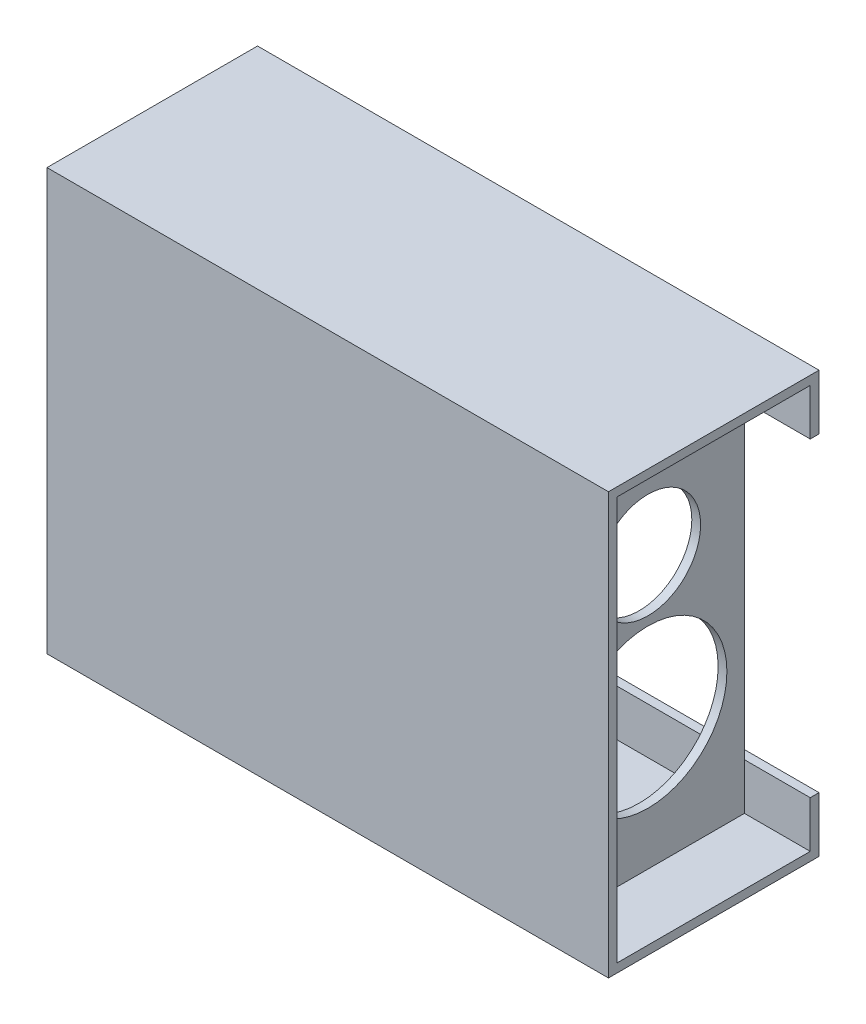
ISO-10303-21;
HEADER;
FILE_DESCRIPTION(('STEP AP214'),'2;1');
FILE_NAME('part.step','',(''),(''),'','','');
FILE_SCHEMA(('AUTOMOTIVE_DESIGN { 1 0 10303 214 1 1 1 1 }'));
ENDSEC;
DATA;
#1=APPLICATION_CONTEXT('core data for automotive mechanical design processes');
#2=APPLICATION_PROTOCOL_DEFINITION('international standard','automotive_design',2000,#1);
#3=PRODUCT_CONTEXT('',#1,'mechanical');
#4=PRODUCT('Part','Part','',(#3));
#5=PRODUCT_RELATED_PRODUCT_CATEGORY('part','',(#4));
#6=PRODUCT_DEFINITION_FORMATION('','',#4);
#7=PRODUCT_DEFINITION_CONTEXT('part definition',#1,'design');
#8=PRODUCT_DEFINITION('design','',#6,#7);
#9=PRODUCT_DEFINITION_SHAPE('','',#8);
#10=(LENGTH_UNIT() NAMED_UNIT(*) SI_UNIT(.MILLI.,.METRE.));
#11=(NAMED_UNIT(*) PLANE_ANGLE_UNIT() SI_UNIT($,.RADIAN.));
#12=(NAMED_UNIT(*) SI_UNIT($,.STERADIAN.) SOLID_ANGLE_UNIT());
#13=UNCERTAINTY_MEASURE_WITH_UNIT(LENGTH_MEASURE(1.E-05),#10,'distance_accuracy_value','');
#14=(GEOMETRIC_REPRESENTATION_CONTEXT(3) GLOBAL_UNCERTAINTY_ASSIGNED_CONTEXT((#13)) GLOBAL_UNIT_ASSIGNED_CONTEXT((#10,
#11,#12)) REPRESENTATION_CONTEXT('',''));
#15=CARTESIAN_POINT('',(0.,0.,0.));
#16=DIRECTION('',(0.,0.,1.));
#17=DIRECTION('',(1.,0.,0.));
#18=AXIS2_PLACEMENT_3D('',#15,#16,#17);
#19=CARTESIAN_POINT('',(176.2125,-67.0591637010676,-37.7723309608541));
#20=DIRECTION('',(0.,0.,1.));
#21=DIRECTION('',(1.,0.,0.));
#22=AXIS2_PLACEMENT_3D('',#19,#20,#21);
#23=PLANE('',#22);
#24=DIRECTION('',(0.,1.,0.));
#25=VECTOR('',#24,1.);
#26=CARTESIAN_POINT('',(77.7875,-67.0591637010676,-37.7723309608541));
#27=LINE('',#26,#25);
#28=CARTESIAN_POINT('',(77.7875,62.1658362989324,-37.7723309608541));
#29=VERTEX_POINT('',#28);
#30=CARTESIAN_POINT('',(77.7875,78.9908362989324,-37.7723309608541));
#31=VERTEX_POINT('',#30);
#32=EDGE_CURVE('E365',#29,#31,#27,.T.);
#33=ORIENTED_EDGE('',*,*,#32,.F.);
#34=DIRECTION('',(1.,0.,0.));
#35=VECTOR('',#34,1.);
#36=CARTESIAN_POINT('',(15.,62.1658362989324,-37.7723309608541));
#37=LINE('',#36,#35);
#38=CARTESIAN_POINT('',(176.2125,62.1658362989324,-37.7723309608541));
#39=VERTEX_POINT('',#38);
#40=EDGE_CURVE('E539',#29,#39,#37,.T.);
#41=ORIENTED_EDGE('',*,*,#40,.T.);
#42=DIRECTION('',(0.,1.,0.));
#43=VECTOR('',#42,1.);
#44=CARTESIAN_POINT('',(176.2125,-67.0591637010676,-37.7723309608541));
#45=LINE('',#44,#43);
#46=CARTESIAN_POINT('',(176.2125,78.9908362989324,-37.7723309608541));
#47=VERTEX_POINT('',#46);
#48=EDGE_CURVE('E347',#39,#47,#45,.T.);
#49=ORIENTED_EDGE('',*,*,#48,.T.);
#50=DIRECTION('',(-1.,0.,0.));
#51=VECTOR('',#50,1.);
#52=CARTESIAN_POINT('',(176.2125,78.9908362989324,-37.7723309608541));
#53=LINE('',#52,#51);
#54=EDGE_CURVE('E382',#47,#31,#53,.T.);
#55=ORIENTED_EDGE('',*,*,#54,.T.);
#56=EDGE_LOOP('',(#33,#41,#49,#55));
#57=FACE_BOUND('',#56,.T.);
#58=ADVANCED_FACE('F47',(#57),#23,.T.);
#59=CARTESIAN_POINT('',(176.2125,-67.0591637010676,-37.7723309608541));
#60=VERTEX_POINT('',#59);
#61=CARTESIAN_POINT('',(176.2125,-50.2341637010676,-37.7723309608541));
#62=VERTEX_POINT('',#61);
#63=EDGE_CURVE('E349',#60,#62,#45,.T.);
#64=ORIENTED_EDGE('',*,*,#63,.T.);
#65=DIRECTION('',(-1.,0.,0.));
#66=VECTOR('',#65,1.);
#67=CARTESIAN_POINT('',(203.2,-50.2341637010676,-37.7723309608541));
#68=LINE('',#67,#66);
#69=CARTESIAN_POINT('',(77.7875,-50.2341637010676,-37.7723309608541));
#70=VERTEX_POINT('',#69);
#71=EDGE_CURVE('E702',#62,#70,#68,.T.);
#72=ORIENTED_EDGE('',*,*,#71,.T.);
#73=CARTESIAN_POINT('',(77.7875,-67.0591637010676,-37.7723309608541));
#74=VERTEX_POINT('',#73);
#75=EDGE_CURVE('E366',#74,#70,#27,.T.);
#76=ORIENTED_EDGE('',*,*,#75,.F.);
#77=DIRECTION('',(-1.,0.,0.));
#78=VECTOR('',#77,1.);
#79=CARTESIAN_POINT('',(176.2125,-67.0591637010676,-37.7723309608541));
#80=LINE('',#79,#78);
#81=EDGE_CURVE('E386',#60,#74,#80,.T.);
#82=ORIENTED_EDGE('',*,*,#81,.F.);
#83=EDGE_LOOP('',(#64,#72,#76,#82));
#84=FACE_BOUND('',#83,.T.);
#85=ADVANCED_FACE('F592',(#84),#23,.T.);
#86=CARTESIAN_POINT('',(74.6125,-67.0591637010676,-37.7723309608541));
#87=DIRECTION('',(0.,0.,1.));
#88=DIRECTION('',(1.,0.,0.));
#89=AXIS2_PLACEMENT_3D('',#86,#87,#88);
#90=PLANE('',#89);
#91=DIRECTION('',(0.,1.,0.));
#92=VECTOR('',#91,1.);
#93=CARTESIAN_POINT('',(15.,-50.2341637010676,-37.7723309608541));
#94=LINE('',#93,#92);
#95=CARTESIAN_POINT('',(15.,-50.2341637010676,-37.7723309608541));
#96=VERTEX_POINT('',#95);
#97=CARTESIAN_POINT('',(15.,62.1658362989324,-37.7723309608541));
#98=VERTEX_POINT('',#97);
#99=EDGE_CURVE('E71',#96,#98,#94,.T.);
#100=ORIENTED_EDGE('',*,*,#99,.T.);
#101=CARTESIAN_POINT('',(74.6125,62.1658362989324,-37.7723309608541));
#102=VERTEX_POINT('',#101);
#103=EDGE_CURVE('E234',#98,#102,#37,.T.);
#104=ORIENTED_EDGE('',*,*,#103,.T.);
#105=DIRECTION('',(0.,1.,0.));
#106=VECTOR('',#105,1.);
#107=CARTESIAN_POINT('',(74.6125,-67.0591637010676,-37.7723309608541));
#108=LINE('',#107,#106);
#109=CARTESIAN_POINT('',(74.6125,78.9908362989324,-37.7723309608541));
#110=VERTEX_POINT('',#109);
#111=EDGE_CURVE('E395',#102,#110,#108,.T.);
#112=ORIENTED_EDGE('',*,*,#111,.T.);
#113=DIRECTION('',(-1.,0.,0.));
#114=VECTOR('',#113,1.);
#115=CARTESIAN_POINT('',(74.6125,78.9908362989324,-37.7723309608541));
#116=LINE('',#115,#114);
#117=CARTESIAN_POINT('',(3.175,78.9908362989324,-37.7723309608541));
#118=VERTEX_POINT('',#117);
#119=EDGE_CURVE('E428',#110,#118,#116,.T.);
#120=ORIENTED_EDGE('',*,*,#119,.T.);
#121=DIRECTION('',(0.,1.,0.));
#122=VECTOR('',#121,1.);
#123=CARTESIAN_POINT('',(3.175,-67.0591637010676,-37.7723309608541));
#124=LINE('',#123,#122);
#125=CARTESIAN_POINT('',(3.175,-67.0591637010676,-37.7723309608541));
#126=VERTEX_POINT('',#125);
#127=EDGE_CURVE('E413',#126,#118,#124,.T.);
#128=ORIENTED_EDGE('',*,*,#127,.F.);
#129=DIRECTION('',(-1.,0.,0.));
#130=VECTOR('',#129,1.);
#131=CARTESIAN_POINT('',(74.6125,-67.0591637010676,-37.7723309608541));
#132=LINE('',#131,#130);
#133=CARTESIAN_POINT('',(74.6125,-67.0591637010676,-37.7723309608541));
#134=VERTEX_POINT('',#133);
#135=EDGE_CURVE('E432',#134,#126,#132,.T.);
#136=ORIENTED_EDGE('',*,*,#135,.F.);
#137=CARTESIAN_POINT('',(74.6125,-50.2341637010676,-37.7723309608541));
#138=VERTEX_POINT('',#137);
#139=EDGE_CURVE('E397',#134,#138,#108,.T.);
#140=ORIENTED_EDGE('',*,*,#139,.T.);
#141=EDGE_CURVE('E221',#138,#96,#68,.T.);
#142=ORIENTED_EDGE('',*,*,#141,.T.);
#143=EDGE_LOOP('',(#100,#104,#112,#120,#128,#136,#140,#142));
#144=FACE_BOUND('',#143,.T.);
#145=ADVANCED_FACE('F485',(#144),#90,.T.);
#146=CARTESIAN_POINT('',(203.2,-67.0591637010676,-37.7723309608541));
#147=DIRECTION('',(0.,0.,1.));
#148=DIRECTION('',(1.,0.,0.));
#149=AXIS2_PLACEMENT_3D('',#146,#147,#148);
#150=PLANE('',#149);
#151=DIRECTION('',(-1.,0.,0.));
#152=VECTOR('',#151,1.);
#153=CARTESIAN_POINT('',(203.2,62.1658362989324,-37.7723309608541));
#154=LINE('',#153,#152);
#155=CARTESIAN_POINT('',(203.2,62.1658362989324,-37.7723309608541));
#156=VERTEX_POINT('',#155);
#157=CARTESIAN_POINT('',(179.3875,62.1658362989324,-37.7723309608541));
#158=VERTEX_POINT('',#157);
#159=EDGE_CURVE('E11',#156,#158,#154,.T.);
#160=ORIENTED_EDGE('',*,*,#159,.F.);
#161=DIRECTION('',(0.,1.,0.));
#162=VECTOR('',#161,1.);
#163=CARTESIAN_POINT('',(203.2,-67.0591637010676,-37.7723309608541));
#164=LINE('',#163,#162);
#165=CARTESIAN_POINT('',(203.2,78.9908362989324,-37.7723309608541));
#166=VERTEX_POINT('',#165);
#167=EDGE_CURVE('E242',#156,#166,#164,.T.);
#168=ORIENTED_EDGE('',*,*,#167,.T.);
#169=DIRECTION('',(-1.,0.,0.));
#170=VECTOR('',#169,1.);
#171=CARTESIAN_POINT('',(203.2,78.9908362989324,-37.7723309608541));
#172=LINE('',#171,#170);
#173=CARTESIAN_POINT('',(179.3875,78.9908362989324,-37.7723309608541));
#174=VERTEX_POINT('',#173);
#175=EDGE_CURVE('E277',#166,#174,#172,.T.);
#176=ORIENTED_EDGE('',*,*,#175,.T.);
#177=DIRECTION('',(0.,1.,0.));
#178=VECTOR('',#177,1.);
#179=CARTESIAN_POINT('',(179.3875,-67.0591637010676,-37.7723309608541));
#180=LINE('',#179,#178);
#181=EDGE_CURVE('E258',#158,#174,#180,.T.);
#182=ORIENTED_EDGE('',*,*,#181,.F.);
#183=EDGE_LOOP('',(#160,#168,#176,#182));
#184=FACE_BOUND('',#183,.T.);
#185=ADVANCED_FACE('F580',(#184),#150,.T.);
#186=CARTESIAN_POINT('',(3.175,-70.2341637010676,35.2526690391459));
#187=DIRECTION('',(0.,1.,0.));
#188=DIRECTION('',(0.,0.,1.));
#189=AXIS2_PLACEMENT_3D('',#186,#187,#188);
#190=PLANE('',#189);
#191=DIRECTION('',(0.,0.,-1.));
#192=VECTOR('',#191,1.);
#193=CARTESIAN_POINT('',(0.,-70.2341637010676,35.2526690391459));
#194=LINE('',#193,#192);
#195=CARTESIAN_POINT('',(0.,-70.2341637010676,35.2526690391459));
#196=VERTEX_POINT('',#195);
#197=CARTESIAN_POINT('',(0.,-70.2341637010676,-40.9473309608541));
#198=VERTEX_POINT('',#197);
#199=EDGE_CURVE('E436',#196,#198,#194,.T.);
#200=ORIENTED_EDGE('',*,*,#199,.T.);
#201=DIRECTION('',(-1.,0.,0.));
#202=VECTOR('',#201,1.);
#203=CARTESIAN_POINT('',(3.175,-70.2341637010676,-40.9473309608541));
#204=LINE('',#203,#202);
#205=CARTESIAN_POINT('',(203.2,-70.2341637010676,-40.9473309608541));
#206=VERTEX_POINT('',#205);
#207=EDGE_CURVE('E56',#206,#198,#204,.T.);
#208=ORIENTED_EDGE('',*,*,#207,.F.);
#209=DIRECTION('',(0.,0.,-1.));
#210=VECTOR('',#209,1.);
#211=CARTESIAN_POINT('',(203.2,-70.2341637010676,35.2526690391459));
#212=LINE('',#211,#210);
#213=CARTESIAN_POINT('',(203.2,-70.2341637010676,35.2526690391459));
#214=VERTEX_POINT('',#213);
#215=EDGE_CURVE('E283',#214,#206,#212,.T.);
#216=ORIENTED_EDGE('',*,*,#215,.F.);
#217=DIRECTION('',(-1.,0.,0.));
#218=VECTOR('',#217,1.);
#219=CARTESIAN_POINT('',(3.175,-70.2341637010676,35.2526690391459));
#220=LINE('',#219,#218);
#221=EDGE_CURVE('E449',#214,#196,#220,.T.);
#222=ORIENTED_EDGE('',*,*,#221,.T.);
#223=EDGE_LOOP('',(#200,#208,#216,#222));
#224=FACE_BOUND('',#223,.T.);
#225=ADVANCED_FACE('F49',(#224),#190,.F.);
#226=CARTESIAN_POINT('',(3.175,-70.2341637010676,-40.9473309608541));
#227=DIRECTION('',(0.,0.,1.));
#228=DIRECTION('',(1.,0.,0.));
#229=AXIS2_PLACEMENT_3D('',#226,#227,#228);
#230=PLANE('',#229);
#231=DIRECTION('',(0.,1.,0.));
#232=VECTOR('',#231,1.);
#233=CARTESIAN_POINT('',(203.2,-70.2341637010676,-40.9473309608541));
#234=LINE('',#233,#232);
#235=CARTESIAN_POINT('',(203.2,62.1658362989324,-40.9473309608541));
#236=VERTEX_POINT('',#235);
#237=CARTESIAN_POINT('',(203.2,82.1658362989324,-40.9473309608541));
#238=VERTEX_POINT('',#237);
#239=EDGE_CURVE('E286',#236,#238,#234,.T.);
#240=ORIENTED_EDGE('',*,*,#239,.F.);
#241=DIRECTION('',(1.,0.,0.));
#242=VECTOR('',#241,1.);
#243=CARTESIAN_POINT('',(15.,62.1658362989324,-40.9473309608541));
#244=LINE('',#243,#242);
#245=CARTESIAN_POINT('',(15.,62.1658362989324,-40.9473309608541));
#246=VERTEX_POINT('',#245);
#247=EDGE_CURVE('E514',#246,#236,#244,.T.);
#248=ORIENTED_EDGE('',*,*,#247,.F.);
#249=DIRECTION('',(0.,1.,0.));
#250=VECTOR('',#249,1.);
#251=CARTESIAN_POINT('',(15.,-50.2341637010676,-40.9473309608541));
#252=LINE('',#251,#250);
#253=CARTESIAN_POINT('',(15.,-50.2341637010676,-40.9473309608541));
#254=VERTEX_POINT('',#253);
#255=EDGE_CURVE('E521',#254,#246,#252,.T.);
#256=ORIENTED_EDGE('',*,*,#255,.F.);
#257=DIRECTION('',(-1.,0.,0.));
#258=VECTOR('',#257,1.);
#259=CARTESIAN_POINT('',(203.2,-50.2341637010676,-40.9473309608541));
#260=LINE('',#259,#258);
#261=CARTESIAN_POINT('',(203.2,-50.2341637010676,-40.9473309608541));
#262=VERTEX_POINT('',#261);
#263=EDGE_CURVE('E524',#262,#254,#260,.T.);
#264=ORIENTED_EDGE('',*,*,#263,.F.);
#265=EDGE_CURVE('E231',#206,#262,#234,.T.);
#266=ORIENTED_EDGE('',*,*,#265,.F.);
#267=ORIENTED_EDGE('',*,*,#207,.T.);
#268=DIRECTION('',(0.,1.,0.));
#269=VECTOR('',#268,1.);
#270=CARTESIAN_POINT('',(0.,-70.2341637010676,-40.9473309608541));
#271=LINE('',#270,#269);
#272=CARTESIAN_POINT('',(0.,82.1658362989324,-40.9473309608541));
#273=VERTEX_POINT('',#272);
#274=EDGE_CURVE('E440',#198,#273,#271,.T.);
#275=ORIENTED_EDGE('',*,*,#274,.T.);
#276=DIRECTION('',(-1.,0.,0.));
#277=VECTOR('',#276,1.);
#278=CARTESIAN_POINT('',(3.175,82.1658362989324,-40.9473309608541));
#279=LINE('',#278,#277);
#280=EDGE_CURVE('E457',#238,#273,#279,.T.);
#281=ORIENTED_EDGE('',*,*,#280,.F.);
#282=EDGE_LOOP('',(#240,#248,#256,#264,#266,#267,#275,#281));
#283=FACE_BOUND('',#282,.T.);
#284=ADVANCED_FACE('F528',(#283),#230,.F.);
#285=CARTESIAN_POINT('',(3.175,82.1658362989324,35.2526690391459));
#286=DIRECTION('',(0.,-1.,0.));
#287=DIRECTION('',(0.,0.,-1.));
#288=AXIS2_PLACEMENT_3D('',#285,#286,#287);
#289=PLANE('',#288);
#290=DIRECTION('',(0.,0.,1.));
#291=VECTOR('',#290,1.);
#292=CARTESIAN_POINT('',(0.,82.1658362989324,35.2526690391459));
#293=LINE('',#292,#291);
#294=CARTESIAN_POINT('',(0.,82.1658362989324,35.2526690391459));
#295=VERTEX_POINT('',#294);
#296=EDGE_CURVE('E443',#273,#295,#293,.T.);
#297=ORIENTED_EDGE('',*,*,#296,.T.);
#298=DIRECTION('',(-1.,0.,0.));
#299=VECTOR('',#298,1.);
#300=CARTESIAN_POINT('',(3.175,82.1658362989324,35.2526690391459));
#301=LINE('',#300,#299);
#302=CARTESIAN_POINT('',(203.2,82.1658362989324,35.2526690391459));
#303=VERTEX_POINT('',#302);
#304=EDGE_CURVE('E453',#303,#295,#301,.T.);
#305=ORIENTED_EDGE('',*,*,#304,.F.);
#306=DIRECTION('',(0.,0.,1.));
#307=VECTOR('',#306,1.);
#308=CARTESIAN_POINT('',(203.2,82.1658362989324,35.2526690391459));
#309=LINE('',#308,#307);
#310=EDGE_CURVE('E289',#238,#303,#309,.T.);
#311=ORIENTED_EDGE('',*,*,#310,.F.);
#312=ORIENTED_EDGE('',*,*,#280,.T.);
#313=EDGE_LOOP('',(#297,#305,#311,#312));
#314=FACE_BOUND('',#313,.T.);
#315=ADVANCED_FACE('F630',(#314),#289,.F.);
#316=CARTESIAN_POINT('',(3.175,-70.2341637010676,35.2526690391459));
#317=DIRECTION('',(0.,0.,-1.));
#318=DIRECTION('',(-1.,0.,0.));
#319=AXIS2_PLACEMENT_3D('',#316,#317,#318);
#320=PLANE('',#319);
#321=DIRECTION('',(0.,-1.,0.));
#322=VECTOR('',#321,1.);
#323=CARTESIAN_POINT('',(0.,-70.2341637010676,35.2526690391459));
#324=LINE('',#323,#322);
#325=EDGE_CURVE('E446',#295,#196,#324,.T.);
#326=ORIENTED_EDGE('',*,*,#325,.T.);
#327=ORIENTED_EDGE('',*,*,#221,.F.);
#328=DIRECTION('',(0.,-1.,0.));
#329=VECTOR('',#328,1.);
#330=CARTESIAN_POINT('',(203.2,-70.2341637010676,35.2526690391459));
#331=LINE('',#330,#329);
#332=EDGE_CURVE('E293',#303,#214,#331,.T.);
#333=ORIENTED_EDGE('',*,*,#332,.F.);
#334=ORIENTED_EDGE('',*,*,#304,.T.);
#335=EDGE_LOOP('',(#326,#327,#333,#334));
#336=FACE_BOUND('',#335,.T.);
#337=ADVANCED_FACE('F626',(#336),#320,.F.);
#338=CARTESIAN_POINT('',(0.,0.,0.));
#339=DIRECTION('',(1.,0.,0.));
#340=DIRECTION('',(0.,0.,-1.));
#341=AXIS2_PLACEMENT_3D('',#338,#339,#340);
#342=PLANE('',#341);
#343=CARTESIAN_POINT('',(0.,31.3658362989324,-2.8473309608541));
#344=DIRECTION('',(-1.,0.,0.));
#345=DIRECTION('',(0.,0.,1.));
#346=AXIS2_PLACEMENT_3D('',#343,#344,#345);
#347=CIRCLE('',#346,19.05);
#348=CARTESIAN_POINT('',(0.,31.3658362989324,16.2026690391459));
#349=VERTEX_POINT('',#348);
#350=EDGE_CURVE('E313',#349,#349,#347,.T.);
#351=ORIENTED_EDGE('',*,*,#350,.F.);
#352=EDGE_LOOP('',(#351));
#353=FACE_BOUND('',#352,.T.);
#354=CARTESIAN_POINT('',(0.,-19.4341637010676,-2.8473309608541));
#355=DIRECTION('',(1.,0.,0.));
#356=DIRECTION('',(0.,0.,-1.));
#357=AXIS2_PLACEMENT_3D('',#354,#355,#356);
#358=CIRCLE('',#357,12.7);
#359=CARTESIAN_POINT('',(0.,-19.4341637010676,-15.5473309608541));
#360=VERTEX_POINT('',#359);
#361=EDGE_CURVE('E322',#360,#360,#358,.T.);
#362=ORIENTED_EDGE('',*,*,#361,.T.);
#363=EDGE_LOOP('',(#362));
#364=FACE_BOUND('',#363,.T.);
#365=ORIENTED_EDGE('',*,*,#199,.F.);
#366=ORIENTED_EDGE('',*,*,#325,.F.);
#367=ORIENTED_EDGE('',*,*,#296,.F.);
#368=ORIENTED_EDGE('',*,*,#274,.F.);
#369=EDGE_LOOP('',(#365,#366,#367,#368));
#370=FACE_BOUND('',#369,.T.);
#371=ADVANCED_FACE('F606',(#353,#364,#370),#342,.F.);
#372=CARTESIAN_POINT('',(176.2125,-67.0591637010676,32.0776690391459));
#373=DIRECTION('',(0.,1.,0.));
#374=DIRECTION('',(0.,0.,1.));
#375=AXIS2_PLACEMENT_3D('',#372,#373,#374);
#376=PLANE('',#375);
#377=DIRECTION('',(0.,0.,-1.));
#378=VECTOR('',#377,1.);
#379=CARTESIAN_POINT('',(77.7875,-67.0591637010676,32.0776690391459));
#380=LINE('',#379,#378);
#381=CARTESIAN_POINT('',(77.7875,-67.0591637010676,32.0776690391459));
#382=VERTEX_POINT('',#381);
#383=EDGE_CURVE('E342',#382,#74,#380,.T.);
#384=ORIENTED_EDGE('',*,*,#383,.F.);
#385=DIRECTION('',(-1.,0.,0.));
#386=VECTOR('',#385,1.);
#387=CARTESIAN_POINT('',(176.2125,-67.0591637010676,32.0776690391459));
#388=LINE('',#387,#386);
#389=CARTESIAN_POINT('',(176.2125,-67.0591637010676,32.0776690391459));
#390=VERTEX_POINT('',#389);
#391=EDGE_CURVE('E362',#390,#382,#388,.T.);
#392=ORIENTED_EDGE('',*,*,#391,.F.);
#393=DIRECTION('',(0.,0.,-1.));
#394=VECTOR('',#393,1.);
#395=CARTESIAN_POINT('',(176.2125,-67.0591637010676,32.0776690391459));
#396=LINE('',#395,#394);
#397=EDGE_CURVE('E343',#390,#60,#396,.T.);
#398=ORIENTED_EDGE('',*,*,#397,.T.);
#399=ORIENTED_EDGE('',*,*,#81,.T.);
#400=EDGE_LOOP('',(#384,#392,#398,#399));
#401=FACE_BOUND('',#400,.T.);
#402=ADVANCED_FACE('F603',(#401),#376,.T.);
#403=CARTESIAN_POINT('',(176.2125,78.9908362989324,32.0776690391459));
#404=DIRECTION('',(0.,-1.,0.));
#405=DIRECTION('',(0.,0.,-1.));
#406=AXIS2_PLACEMENT_3D('',#403,#404,#405);
#407=PLANE('',#406);
#408=DIRECTION('',(0.,0.,1.));
#409=VECTOR('',#408,1.);
#410=CARTESIAN_POINT('',(77.7875,78.9908362989324,32.0776690391459));
#411=LINE('',#410,#409);
#412=CARTESIAN_POINT('',(77.7875,78.9908362989324,32.0776690391459));
#413=VERTEX_POINT('',#412);
#414=EDGE_CURVE('E370',#31,#413,#411,.T.);
#415=ORIENTED_EDGE('',*,*,#414,.F.);
#416=ORIENTED_EDGE('',*,*,#54,.F.);
#417=DIRECTION('',(0.,0.,1.));
#418=VECTOR('',#417,1.);
#419=CARTESIAN_POINT('',(176.2125,78.9908362989324,32.0776690391459));
#420=LINE('',#419,#418);
#421=CARTESIAN_POINT('',(176.2125,78.9908362989324,32.0776690391459));
#422=VERTEX_POINT('',#421);
#423=EDGE_CURVE('E353',#47,#422,#420,.T.);
#424=ORIENTED_EDGE('',*,*,#423,.T.);
#425=DIRECTION('',(-1.,0.,0.));
#426=VECTOR('',#425,1.);
#427=CARTESIAN_POINT('',(176.2125,78.9908362989324,32.0776690391459));
#428=LINE('',#427,#426);
#429=EDGE_CURVE('E378',#422,#413,#428,.T.);
#430=ORIENTED_EDGE('',*,*,#429,.T.);
#431=EDGE_LOOP('',(#415,#416,#424,#430));
#432=FACE_BOUND('',#431,.T.);
#433=ADVANCED_FACE('F601',(#432),#407,.T.);
#434=CARTESIAN_POINT('',(176.2125,-67.0591637010676,32.0776690391459));
#435=DIRECTION('',(0.,0.,-1.));
#436=DIRECTION('',(-1.,0.,0.));
#437=AXIS2_PLACEMENT_3D('',#434,#435,#436);
#438=PLANE('',#437);
#439=DIRECTION('',(0.,-1.,0.));
#440=VECTOR('',#439,1.);
#441=CARTESIAN_POINT('',(77.7875,-67.0591637010676,32.0776690391459));
#442=LINE('',#441,#440);
#443=EDGE_CURVE('E348',#413,#382,#442,.T.);
#444=ORIENTED_EDGE('',*,*,#443,.F.);
#445=ORIENTED_EDGE('',*,*,#429,.F.);
#446=DIRECTION('',(0.,-1.,0.));
#447=VECTOR('',#446,1.);
#448=CARTESIAN_POINT('',(176.2125,-67.0591637010676,32.0776690391459));
#449=LINE('',#448,#447);
#450=EDGE_CURVE('E358',#422,#390,#449,.T.);
#451=ORIENTED_EDGE('',*,*,#450,.T.);
#452=ORIENTED_EDGE('',*,*,#391,.T.);
#453=EDGE_LOOP('',(#444,#445,#451,#452));
#454=FACE_BOUND('',#453,.T.);
#455=ADVANCED_FACE('F610',(#454),#438,.T.);
#456=CARTESIAN_POINT('',(77.7875,0.,0.));
#457=DIRECTION('',(1.,0.,0.));
#458=DIRECTION('',(0.,0.,-1.));
#459=AXIS2_PLACEMENT_3D('',#456,#457,#458);
#460=PLANE('',#459);
#461=CARTESIAN_POINT('',(77.7875,-19.4341637010676,-2.8473309608541));
#462=DIRECTION('',(1.,0.,0.));
#463=DIRECTION('',(0.,0.,-1.));
#464=AXIS2_PLACEMENT_3D('',#461,#462,#463);
#465=CIRCLE('',#464,12.7);
#466=CARTESIAN_POINT('',(77.7875,-19.4341637010676,-15.5473309608541));
#467=VERTEX_POINT('',#466);
#468=EDGE_CURVE('E318',#467,#467,#465,.T.);
#469=ORIENTED_EDGE('',*,*,#468,.F.);
#470=EDGE_LOOP('',(#469));
#471=FACE_BOUND('',#470,.T.);
#472=CARTESIAN_POINT('',(77.7875,31.3658362989324,-2.8473309608541));
#473=DIRECTION('',(1.,0.,0.));
#474=DIRECTION('',(0.,0.,-1.));
#475=AXIS2_PLACEMENT_3D('',#472,#473,#474);
#476=CIRCLE('',#475,12.7);
#477=CARTESIAN_POINT('',(77.7875,31.3658362989324,-15.5473309608541));
#478=VERTEX_POINT('',#477);
#479=EDGE_CURVE('E334',#478,#478,#476,.T.);
#480=ORIENTED_EDGE('',*,*,#479,.F.);
#481=EDGE_LOOP('',(#480));
#482=FACE_BOUND('',#481,.T.);
#483=ORIENTED_EDGE('',*,*,#383,.T.);
#484=ORIENTED_EDGE('',*,*,#75,.T.);
#485=EDGE_CURVE('E259',#70,#29,#27,.T.);
#486=ORIENTED_EDGE('',*,*,#485,.T.);
#487=ORIENTED_EDGE('',*,*,#32,.T.);
#488=ORIENTED_EDGE('',*,*,#414,.T.);
#489=ORIENTED_EDGE('',*,*,#443,.T.);
#490=EDGE_LOOP('',(#483,#484,#486,#487,#488,#489));
#491=FACE_BOUND('',#490,.T.);
#492=ADVANCED_FACE('F558',(#471,#482,#491),#460,.T.);
#493=CARTESIAN_POINT('',(77.7875,31.3658362989324,-2.8473309608541));
#494=DIRECTION('',(1.,0.,0.));
#495=DIRECTION('',(0.,0.,-1.));
#496=AXIS2_PLACEMENT_3D('',#493,#494,#495);
#497=CYLINDRICAL_SURFACE('',#496,12.7);
#498=ORIENTED_EDGE('',*,*,#479,.T.);
#499=EDGE_LOOP('',(#498));
#500=FACE_BOUND('',#499,.T.);
#501=CARTESIAN_POINT('',(74.6125,31.3658362989324,-2.8473309608541));
#502=DIRECTION('',(1.,0.,0.));
#503=DIRECTION('',(0.,0.,-1.));
#504=AXIS2_PLACEMENT_3D('',#501,#502,#503);
#505=CIRCLE('',#504,12.7);
#506=CARTESIAN_POINT('',(74.6125,31.3658362989324,-15.5473309608541));
#507=VERTEX_POINT('',#506);
#508=EDGE_CURVE('E338',#507,#507,#505,.T.);
#509=ORIENTED_EDGE('',*,*,#508,.F.);
#510=EDGE_LOOP('',(#509));
#511=FACE_BOUND('',#510,.T.);
#512=ADVANCED_FACE('F474',(#500,#511),#497,.F.);
#513=CARTESIAN_POINT('',(3.175,0.,0.));
#514=DIRECTION('',(1.,0.,0.));
#515=DIRECTION('',(0.,0.,-1.));
#516=AXIS2_PLACEMENT_3D('',#513,#514,#515);
#517=PLANE('',#516);
#518=CARTESIAN_POINT('',(3.175,31.3658362989324,-2.8473309608541));
#519=DIRECTION('',(1.,0.,0.));
#520=DIRECTION('',(0.,0.,-1.));
#521=AXIS2_PLACEMENT_3D('',#518,#519,#520);
#522=CIRCLE('',#521,19.05);
#523=CARTESIAN_POINT('',(3.175,31.3658362989324,-21.8973309608541));
#524=VERTEX_POINT('',#523);
#525=EDGE_CURVE('E317',#524,#524,#522,.T.);
#526=ORIENTED_EDGE('',*,*,#525,.F.);
#527=EDGE_LOOP('',(#526));
#528=FACE_BOUND('',#527,.T.);
#529=CARTESIAN_POINT('',(3.175,-19.4341637010676,-2.8473309608541));
#530=DIRECTION('',(1.,0.,0.));
#531=DIRECTION('',(0.,0.,-1.));
#532=AXIS2_PLACEMENT_3D('',#529,#530,#531);
#533=CIRCLE('',#532,12.7);
#534=CARTESIAN_POINT('',(3.175,-19.4341637010676,-15.5473309608541));
#535=VERTEX_POINT('',#534);
#536=EDGE_CURVE('E330',#535,#535,#533,.T.);
#537=ORIENTED_EDGE('',*,*,#536,.F.);
#538=EDGE_LOOP('',(#537));
#539=FACE_BOUND('',#538,.T.);
#540=DIRECTION('',(0.,0.,-1.));
#541=VECTOR('',#540,1.);
#542=CARTESIAN_POINT('',(3.175,-67.0591637010676,32.0776690391459));
#543=LINE('',#542,#541);
#544=CARTESIAN_POINT('',(3.175,-67.0591637010676,32.0776690391459));
#545=VERTEX_POINT('',#544);
#546=EDGE_CURVE('E390',#545,#126,#543,.T.);
#547=ORIENTED_EDGE('',*,*,#546,.T.);
#548=ORIENTED_EDGE('',*,*,#127,.T.);
#549=DIRECTION('',(0.,0.,1.));
#550=VECTOR('',#549,1.);
#551=CARTESIAN_POINT('',(3.175,78.9908362989324,32.0776690391459));
#552=LINE('',#551,#550);
#553=CARTESIAN_POINT('',(3.175,78.9908362989324,32.0776690391459));
#554=VERTEX_POINT('',#553);
#555=EDGE_CURVE('E416',#118,#554,#552,.T.);
#556=ORIENTED_EDGE('',*,*,#555,.T.);
#557=DIRECTION('',(0.,-1.,0.));
#558=VECTOR('',#557,1.);
#559=CARTESIAN_POINT('',(3.175,-67.0591637010676,32.0776690391459));
#560=LINE('',#559,#558);
#561=EDGE_CURVE('E396',#554,#545,#560,.T.);
#562=ORIENTED_EDGE('',*,*,#561,.T.);
#563=EDGE_LOOP('',(#547,#548,#556,#562));
#564=FACE_BOUND('',#563,.T.);
#565=ADVANCED_FACE('F470',(#528,#539,#564),#517,.T.);
#566=CARTESIAN_POINT('',(74.6125,78.9908362989324,32.0776690391459));
#567=DIRECTION('',(0.,-1.,0.));
#568=DIRECTION('',(0.,0.,-1.));
#569=AXIS2_PLACEMENT_3D('',#566,#567,#568);
#570=PLANE('',#569);
#571=ORIENTED_EDGE('',*,*,#555,.F.);
#572=ORIENTED_EDGE('',*,*,#119,.F.);
#573=DIRECTION('',(0.,0.,1.));
#574=VECTOR('',#573,1.);
#575=CARTESIAN_POINT('',(74.6125,78.9908362989324,32.0776690391459));
#576=LINE('',#575,#574);
#577=CARTESIAN_POINT('',(74.6125,78.9908362989324,32.0776690391459));
#578=VERTEX_POINT('',#577);
#579=EDGE_CURVE('E401',#110,#578,#576,.T.);
#580=ORIENTED_EDGE('',*,*,#579,.T.);
#581=DIRECTION('',(-1.,0.,0.));
#582=VECTOR('',#581,1.);
#583=CARTESIAN_POINT('',(74.6125,78.9908362989324,32.0776690391459));
#584=LINE('',#583,#582);
#585=EDGE_CURVE('E424',#578,#554,#584,.T.);
#586=ORIENTED_EDGE('',*,*,#585,.T.);
#587=EDGE_LOOP('',(#571,#572,#580,#586));
#588=FACE_BOUND('',#587,.T.);
#589=ADVANCED_FACE('F473',(#588),#570,.T.);
#590=CARTESIAN_POINT('',(74.6125,-67.0591637010676,32.0776690391459));
#591=DIRECTION('',(0.,0.,-1.));
#592=DIRECTION('',(-1.,0.,0.));
#593=AXIS2_PLACEMENT_3D('',#590,#591,#592);
#594=PLANE('',#593);
#595=ORIENTED_EDGE('',*,*,#561,.F.);
#596=ORIENTED_EDGE('',*,*,#585,.F.);
#597=DIRECTION('',(0.,-1.,0.));
#598=VECTOR('',#597,1.);
#599=CARTESIAN_POINT('',(74.6125,-67.0591637010676,32.0776690391459));
#600=LINE('',#599,#598);
#601=CARTESIAN_POINT('',(74.6125,-67.0591637010676,32.0776690391459));
#602=VERTEX_POINT('',#601);
#603=EDGE_CURVE('E406',#578,#602,#600,.T.);
#604=ORIENTED_EDGE('',*,*,#603,.T.);
#605=DIRECTION('',(-1.,0.,0.));
#606=VECTOR('',#605,1.);
#607=CARTESIAN_POINT('',(74.6125,-67.0591637010676,32.0776690391459));
#608=LINE('',#607,#606);
#609=EDGE_CURVE('E410',#602,#545,#608,.T.);
#610=ORIENTED_EDGE('',*,*,#609,.T.);
#611=EDGE_LOOP('',(#595,#596,#604,#610));
#612=FACE_BOUND('',#611,.T.);
#613=ADVANCED_FACE('F495',(#612),#594,.T.);
#614=CARTESIAN_POINT('',(74.6125,-67.0591637010676,32.0776690391459));
#615=DIRECTION('',(0.,1.,0.));
#616=DIRECTION('',(0.,0.,1.));
#617=AXIS2_PLACEMENT_3D('',#614,#615,#616);
#618=PLANE('',#617);
#619=ORIENTED_EDGE('',*,*,#546,.F.);
#620=ORIENTED_EDGE('',*,*,#609,.F.);
#621=DIRECTION('',(0.,0.,-1.));
#622=VECTOR('',#621,1.);
#623=CARTESIAN_POINT('',(74.6125,-67.0591637010676,32.0776690391459));
#624=LINE('',#623,#622);
#625=EDGE_CURVE('E391',#602,#134,#624,.T.);
#626=ORIENTED_EDGE('',*,*,#625,.T.);
#627=ORIENTED_EDGE('',*,*,#135,.T.);
#628=EDGE_LOOP('',(#619,#620,#626,#627));
#629=FACE_BOUND('',#628,.T.);
#630=ADVANCED_FACE('F488',(#629),#618,.T.);
#631=CARTESIAN_POINT('',(74.6125,0.,0.));
#632=DIRECTION('',(1.,0.,0.));
#633=DIRECTION('',(0.,0.,-1.));
#634=AXIS2_PLACEMENT_3D('',#631,#632,#633);
#635=PLANE('',#634);
#636=CARTESIAN_POINT('',(74.6125,-19.4341637010676,-2.8473309608541));
#637=DIRECTION('',(1.,0.,0.));
#638=DIRECTION('',(0.,0.,-1.));
#639=AXIS2_PLACEMENT_3D('',#636,#637,#638);
#640=CIRCLE('',#639,12.7);
#641=CARTESIAN_POINT('',(74.6125,-19.4341637010676,-15.5473309608541));
#642=VERTEX_POINT('',#641);
#643=EDGE_CURVE('E326',#642,#642,#640,.T.);
#644=ORIENTED_EDGE('',*,*,#643,.T.);
#645=EDGE_LOOP('',(#644));
#646=FACE_BOUND('',#645,.T.);
#647=ORIENTED_EDGE('',*,*,#508,.T.);
#648=EDGE_LOOP('',(#647));
#649=FACE_BOUND('',#648,.T.);
#650=ORIENTED_EDGE('',*,*,#139,.F.);
#651=ORIENTED_EDGE('',*,*,#625,.F.);
#652=ORIENTED_EDGE('',*,*,#603,.F.);
#653=ORIENTED_EDGE('',*,*,#579,.F.);
#654=ORIENTED_EDGE('',*,*,#111,.F.);
#655=EDGE_CURVE('E402',#138,#102,#108,.T.);
#656=ORIENTED_EDGE('',*,*,#655,.F.);
#657=EDGE_LOOP('',(#650,#651,#652,#653,#654,#656));
#658=FACE_BOUND('',#657,.T.);
#659=ADVANCED_FACE('F490',(#646,#649,#658),#635,.F.);
#660=CARTESIAN_POINT('',(77.7875,-19.4341637010676,-2.8473309608541));
#661=DIRECTION('',(1.,0.,0.));
#662=DIRECTION('',(0.,0.,-1.));
#663=AXIS2_PLACEMENT_3D('',#660,#661,#662);
#664=CYLINDRICAL_SURFACE('',#663,12.7);
#665=ORIENTED_EDGE('',*,*,#536,.T.);
#666=EDGE_LOOP('',(#665));
#667=FACE_BOUND('',#666,.T.);
#668=ORIENTED_EDGE('',*,*,#361,.F.);
#669=EDGE_LOOP('',(#668));
#670=FACE_BOUND('',#669,.T.);
#671=ADVANCED_FACE('F614',(#667,#670),#664,.F.);
#672=ORIENTED_EDGE('',*,*,#468,.T.);
#673=EDGE_LOOP('',(#672));
#674=FACE_BOUND('',#673,.T.);
#675=ORIENTED_EDGE('',*,*,#643,.F.);
#676=EDGE_LOOP('',(#675));
#677=FACE_BOUND('',#676,.T.);
#678=ADVANCED_FACE('F685',(#674,#677),#664,.F.);
#679=CARTESIAN_POINT('',(0.,31.3658362989324,-2.8473309608541));
#680=DIRECTION('',(-1.,0.,0.));
#681=DIRECTION('',(0.,0.,1.));
#682=AXIS2_PLACEMENT_3D('',#679,#680,#681);
#683=CYLINDRICAL_SURFACE('',#682,19.05);
#684=ORIENTED_EDGE('',*,*,#525,.T.);
#685=EDGE_LOOP('',(#684));
#686=FACE_BOUND('',#685,.T.);
#687=ORIENTED_EDGE('',*,*,#350,.T.);
#688=EDGE_LOOP('',(#687));
#689=FACE_BOUND('',#688,.T.);
#690=ADVANCED_FACE('F467',(#686,#689),#683,.F.);
#691=CARTESIAN_POINT('',(176.2125,0.,0.));
#692=DIRECTION('',(1.,0.,0.));
#693=DIRECTION('',(0.,0.,-1.));
#694=AXIS2_PLACEMENT_3D('',#691,#692,#693);
#695=PLANE('',#694);
#696=CARTESIAN_POINT('',(176.2125,-19.4341637010676,-2.8473309608541));
#697=DIRECTION('',(1.,0.,0.));
#698=DIRECTION('',(0.,0.,-1.));
#699=AXIS2_PLACEMENT_3D('',#696,#697,#698);
#700=CIRCLE('',#699,28.575);
#701=CARTESIAN_POINT('',(176.2125,-19.4341637010676,-31.4223309608541));
#702=VERTEX_POINT('',#701);
#703=EDGE_CURVE('E301',#702,#702,#700,.T.);
#704=ORIENTED_EDGE('',*,*,#703,.T.);
#705=EDGE_LOOP('',(#704));
#706=FACE_BOUND('',#705,.T.);
#707=CARTESIAN_POINT('',(176.2125,31.3658362989324,-2.8473309608541));
#708=DIRECTION('',(1.,0.,0.));
#709=DIRECTION('',(0.,0.,-1.));
#710=AXIS2_PLACEMENT_3D('',#707,#708,#709);
#711=CIRCLE('',#710,19.05);
#712=CARTESIAN_POINT('',(176.2125,31.3658362989324,-21.8973309608541));
#713=VERTEX_POINT('',#712);
#714=EDGE_CURVE('E309',#713,#713,#711,.T.);
#715=ORIENTED_EDGE('',*,*,#714,.T.);
#716=EDGE_LOOP('',(#715));
#717=FACE_BOUND('',#716,.T.);
#718=ORIENTED_EDGE('',*,*,#63,.F.);
#719=ORIENTED_EDGE('',*,*,#397,.F.);
#720=ORIENTED_EDGE('',*,*,#450,.F.);
#721=ORIENTED_EDGE('',*,*,#423,.F.);
#722=ORIENTED_EDGE('',*,*,#48,.F.);
#723=EDGE_CURVE('E354',#62,#39,#45,.T.);
#724=ORIENTED_EDGE('',*,*,#723,.F.);
#725=EDGE_LOOP('',(#718,#719,#720,#721,#722,#724));
#726=FACE_BOUND('',#725,.T.);
#727=ADVANCED_FACE('F678',(#706,#717,#726),#695,.F.);
#728=CARTESIAN_POINT('',(179.3875,0.,0.));
#729=DIRECTION('',(1.,0.,0.));
#730=DIRECTION('',(0.,0.,-1.));
#731=AXIS2_PLACEMENT_3D('',#728,#729,#730);
#732=PLANE('',#731);
#733=DIRECTION('',(0.,0.,-1.));
#734=VECTOR('',#733,1.);
#735=CARTESIAN_POINT('',(179.3875,-67.0591637010676,32.0776690391459));
#736=LINE('',#735,#734);
#737=CARTESIAN_POINT('',(179.3875,-67.0591637010676,32.0776690391459));
#738=VERTEX_POINT('',#737);
#739=CARTESIAN_POINT('',(179.3875,-67.0591637010676,-37.7723309608541));
#740=VERTEX_POINT('',#739);
#741=EDGE_CURVE('E255',#738,#740,#736,.T.);
#742=ORIENTED_EDGE('',*,*,#741,.T.);
#743=CARTESIAN_POINT('',(179.3875,-50.2341637010676,-37.7723309608541));
#744=VERTEX_POINT('',#743);
#745=EDGE_CURVE('E260',#740,#744,#180,.T.);
#746=ORIENTED_EDGE('',*,*,#745,.T.);
#747=EDGE_CURVE('E264',#744,#158,#180,.T.);
#748=ORIENTED_EDGE('',*,*,#747,.T.);
#749=ORIENTED_EDGE('',*,*,#181,.T.);
#750=DIRECTION('',(0.,0.,1.));
#751=VECTOR('',#750,1.);
#752=CARTESIAN_POINT('',(179.3875,78.9908362989324,32.0776690391459));
#753=LINE('',#752,#751);
#754=CARTESIAN_POINT('',(179.3875,78.9908362989324,32.0776690391459));
#755=VERTEX_POINT('',#754);
#756=EDGE_CURVE('E263',#174,#755,#753,.T.);
#757=ORIENTED_EDGE('',*,*,#756,.T.);
#758=DIRECTION('',(0.,-1.,0.));
#759=VECTOR('',#758,1.);
#760=CARTESIAN_POINT('',(179.3875,-67.0591637010676,32.0776690391459));
#761=LINE('',#760,#759);
#762=EDGE_CURVE('E267',#755,#738,#761,.T.);
#763=ORIENTED_EDGE('',*,*,#762,.T.);
#764=EDGE_LOOP('',(#742,#746,#748,#749,#757,#763));
#765=FACE_BOUND('',#764,.T.);
#766=CARTESIAN_POINT('',(179.3875,-19.4341637010676,-2.8473309608541));
#767=DIRECTION('',(1.,0.,0.));
#768=DIRECTION('',(0.,0.,-1.));
#769=AXIS2_PLACEMENT_3D('',#766,#767,#768);
#770=CIRCLE('',#769,28.575);
#771=CARTESIAN_POINT('',(179.3875,-19.4341637010676,-31.4223309608541));
#772=VERTEX_POINT('',#771);
#773=EDGE_CURVE('E297',#772,#772,#770,.T.);
#774=ORIENTED_EDGE('',*,*,#773,.F.);
#775=EDGE_LOOP('',(#774));
#776=FACE_BOUND('',#775,.T.);
#777=CARTESIAN_POINT('',(179.3875,31.3658362989324,-2.8473309608541));
#778=DIRECTION('',(1.,0.,0.));
#779=DIRECTION('',(0.,0.,-1.));
#780=AXIS2_PLACEMENT_3D('',#777,#778,#779);
#781=CIRCLE('',#780,19.05);
#782=CARTESIAN_POINT('',(179.3875,31.3658362989324,-21.8973309608541));
#783=VERTEX_POINT('',#782);
#784=EDGE_CURVE('E305',#783,#783,#781,.T.);
#785=ORIENTED_EDGE('',*,*,#784,.F.);
#786=EDGE_LOOP('',(#785));
#787=FACE_BOUND('',#786,.T.);
#788=ADVANCED_FACE('F674',(#765,#776,#787),#732,.T.);
#789=CARTESIAN_POINT('',(179.3875,31.3658362989324,-2.8473309608541));
#790=DIRECTION('',(1.,0.,0.));
#791=DIRECTION('',(0.,0.,-1.));
#792=AXIS2_PLACEMENT_3D('',#789,#790,#791);
#793=CYLINDRICAL_SURFACE('',#792,19.05);
#794=ORIENTED_EDGE('',*,*,#784,.T.);
#795=EDGE_LOOP('',(#794));
#796=FACE_BOUND('',#795,.T.);
#797=ORIENTED_EDGE('',*,*,#714,.F.);
#798=EDGE_LOOP('',(#797));
#799=FACE_BOUND('',#798,.T.);
#800=ADVANCED_FACE('F670',(#796,#799),#793,.F.);
#801=CARTESIAN_POINT('',(179.3875,-19.4341637010676,-2.8473309608541));
#802=DIRECTION('',(1.,0.,0.));
#803=DIRECTION('',(0.,0.,-1.));
#804=AXIS2_PLACEMENT_3D('',#801,#802,#803);
#805=CYLINDRICAL_SURFACE('',#804,28.575);
#806=ORIENTED_EDGE('',*,*,#773,.T.);
#807=EDGE_LOOP('',(#806));
#808=FACE_BOUND('',#807,.T.);
#809=ORIENTED_EDGE('',*,*,#703,.F.);
#810=EDGE_LOOP('',(#809));
#811=FACE_BOUND('',#810,.T.);
#812=ADVANCED_FACE('F666',(#808,#811),#805,.F.);
#813=CARTESIAN_POINT('',(203.2,0.,0.));
#814=DIRECTION('',(1.,0.,0.));
#815=DIRECTION('',(0.,0.,-1.));
#816=AXIS2_PLACEMENT_3D('',#813,#814,#815);
#817=PLANE('',#816);
#818=DIRECTION('',(0.,0.,-1.));
#819=VECTOR('',#818,1.);
#820=CARTESIAN_POINT('',(203.2,62.1658362989324,-37.7723309608541));
#821=LINE('',#820,#819);
#822=EDGE_CURVE('E501',#156,#236,#821,.T.);
#823=ORIENTED_EDGE('',*,*,#822,.T.);
#824=ORIENTED_EDGE('',*,*,#239,.T.);
#825=ORIENTED_EDGE('',*,*,#310,.T.);
#826=ORIENTED_EDGE('',*,*,#332,.T.);
#827=ORIENTED_EDGE('',*,*,#215,.T.);
#828=ORIENTED_EDGE('',*,*,#265,.T.);
#829=DIRECTION('',(0.,0.,-1.));
#830=VECTOR('',#829,1.);
#831=CARTESIAN_POINT('',(203.2,-50.2341637010676,-37.7723309608541));
#832=LINE('',#831,#830);
#833=CARTESIAN_POINT('',(203.2,-50.2341637010676,-37.7723309608541));
#834=VERTEX_POINT('',#833);
#835=EDGE_CURVE('E210',#834,#262,#832,.T.);
#836=ORIENTED_EDGE('',*,*,#835,.F.);
#837=CARTESIAN_POINT('',(203.2,-67.0591637010676,-37.7723309608541));
#838=VERTEX_POINT('',#837);
#839=EDGE_CURVE('E228',#838,#834,#164,.T.);
#840=ORIENTED_EDGE('',*,*,#839,.F.);
#841=DIRECTION('',(0.,0.,-1.));
#842=VECTOR('',#841,1.);
#843=CARTESIAN_POINT('',(203.2,-67.0591637010676,32.0776690391459));
#844=LINE('',#843,#842);
#845=CARTESIAN_POINT('',(203.2,-67.0591637010676,32.0776690391459));
#846=VERTEX_POINT('',#845);
#847=EDGE_CURVE('E249',#846,#838,#844,.T.);
#848=ORIENTED_EDGE('',*,*,#847,.F.);
#849=DIRECTION('',(0.,-1.,0.));
#850=VECTOR('',#849,1.);
#851=CARTESIAN_POINT('',(203.2,-67.0591637010676,32.0776690391459));
#852=LINE('',#851,#850);
#853=CARTESIAN_POINT('',(203.2,78.9908362989324,32.0776690391459));
#854=VERTEX_POINT('',#853);
#855=EDGE_CURVE('E247',#854,#846,#852,.T.);
#856=ORIENTED_EDGE('',*,*,#855,.F.);
#857=DIRECTION('',(0.,0.,1.));
#858=VECTOR('',#857,1.);
#859=CARTESIAN_POINT('',(203.2,78.9908362989324,32.0776690391459));
#860=LINE('',#859,#858);
#861=EDGE_CURVE('E241',#166,#854,#860,.T.);
#862=ORIENTED_EDGE('',*,*,#861,.F.);
#863=ORIENTED_EDGE('',*,*,#167,.F.);
#864=EDGE_LOOP('',(#823,#824,#825,#826,#827,#828,#836,#840,#848,#856,#862,#863));
#865=FACE_BOUND('',#864,.T.);
#866=ADVANCED_FACE('F226',(#865),#817,.T.);
#867=CARTESIAN_POINT('',(203.2,-67.0591637010676,32.0776690391459));
#868=DIRECTION('',(0.,1.,0.));
#869=DIRECTION('',(0.,0.,1.));
#870=AXIS2_PLACEMENT_3D('',#867,#868,#869);
#871=PLANE('',#870);
#872=ORIENTED_EDGE('',*,*,#741,.F.);
#873=DIRECTION('',(-1.,0.,0.));
#874=VECTOR('',#873,1.);
#875=CARTESIAN_POINT('',(203.2,-67.0591637010676,32.0776690391459));
#876=LINE('',#875,#874);
#877=EDGE_CURVE('E254',#846,#738,#876,.T.);
#878=ORIENTED_EDGE('',*,*,#877,.F.);
#879=ORIENTED_EDGE('',*,*,#847,.T.);
#880=DIRECTION('',(-1.,0.,0.));
#881=VECTOR('',#880,1.);
#882=CARTESIAN_POINT('',(203.2,-67.0591637010676,-37.7723309608541));
#883=LINE('',#882,#881);
#884=EDGE_CURVE('E239',#838,#740,#883,.T.);
#885=ORIENTED_EDGE('',*,*,#884,.T.);
#886=EDGE_LOOP('',(#872,#878,#879,#885));
#887=FACE_BOUND('',#886,.T.);
#888=ADVANCED_FACE('F568',(#887),#871,.T.);
#889=EDGE_CURVE('E206',#834,#744,#68,.T.);
#890=ORIENTED_EDGE('',*,*,#889,.T.);
#891=ORIENTED_EDGE('',*,*,#745,.F.);
#892=ORIENTED_EDGE('',*,*,#884,.F.);
#893=ORIENTED_EDGE('',*,*,#839,.T.);
#894=EDGE_LOOP('',(#890,#891,#892,#893));
#895=FACE_BOUND('',#894,.T.);
#896=ADVANCED_FACE('F237',(#895),#150,.T.);
#897=CARTESIAN_POINT('',(203.2,78.9908362989324,32.0776690391459));
#898=DIRECTION('',(0.,-1.,0.));
#899=DIRECTION('',(0.,0.,-1.));
#900=AXIS2_PLACEMENT_3D('',#897,#898,#899);
#901=PLANE('',#900);
#902=ORIENTED_EDGE('',*,*,#756,.F.);
#903=ORIENTED_EDGE('',*,*,#175,.F.);
#904=ORIENTED_EDGE('',*,*,#861,.T.);
#905=DIRECTION('',(-1.,0.,0.));
#906=VECTOR('',#905,1.);
#907=CARTESIAN_POINT('',(203.2,78.9908362989324,32.0776690391459));
#908=LINE('',#907,#906);
#909=EDGE_CURVE('E273',#854,#755,#908,.T.);
#910=ORIENTED_EDGE('',*,*,#909,.T.);
#911=EDGE_LOOP('',(#902,#903,#904,#910));
#912=FACE_BOUND('',#911,.T.);
#913=ADVANCED_FACE('F577',(#912),#901,.T.);
#914=CARTESIAN_POINT('',(203.2,-67.0591637010676,32.0776690391459));
#915=DIRECTION('',(0.,0.,-1.));
#916=DIRECTION('',(-1.,0.,0.));
#917=AXIS2_PLACEMENT_3D('',#914,#915,#916);
#918=PLANE('',#917);
#919=ORIENTED_EDGE('',*,*,#762,.F.);
#920=ORIENTED_EDGE('',*,*,#909,.F.);
#921=ORIENTED_EDGE('',*,*,#855,.T.);
#922=ORIENTED_EDGE('',*,*,#877,.T.);
#923=EDGE_LOOP('',(#919,#920,#921,#922));
#924=FACE_BOUND('',#923,.T.);
#925=ADVANCED_FACE('F573',(#924),#918,.T.);
#926=CARTESIAN_POINT('',(0.,0.,-37.7723309608541));
#927=DIRECTION('',(0.,0.,-1.));
#928=DIRECTION('',(-1.,0.,0.));
#929=AXIS2_PLACEMENT_3D('',#926,#927,#928);
#930=PLANE('',#929);
#931=ORIENTED_EDGE('',*,*,#723,.T.);
#932=EDGE_CURVE('E535',#39,#158,#37,.T.);
#933=ORIENTED_EDGE('',*,*,#932,.T.);
#934=ORIENTED_EDGE('',*,*,#747,.F.);
#935=EDGE_CURVE('E213',#744,#62,#68,.T.);
#936=ORIENTED_EDGE('',*,*,#935,.T.);
#937=EDGE_LOOP('',(#931,#933,#934,#936));
#938=FACE_BOUND('',#937,.T.);
#939=ADVANCED_FACE('F589',(#938),#930,.T.);
#940=EDGE_CURVE('E63',#70,#138,#68,.T.);
#941=ORIENTED_EDGE('',*,*,#940,.T.);
#942=ORIENTED_EDGE('',*,*,#655,.T.);
#943=EDGE_CURVE('E534',#102,#29,#37,.T.);
#944=ORIENTED_EDGE('',*,*,#943,.T.);
#945=ORIENTED_EDGE('',*,*,#485,.F.);
#946=EDGE_LOOP('',(#941,#942,#944,#945));
#947=FACE_BOUND('',#946,.T.);
#948=ADVANCED_FACE('F549',(#947),#930,.T.);
#949=CARTESIAN_POINT('',(15.,62.1658362989324,-37.7723309608541));
#950=DIRECTION('',(0.,1.,0.));
#951=DIRECTION('',(-1.,0.,0.));
#952=AXIS2_PLACEMENT_3D('',#949,#950,#951);
#953=PLANE('',#952);
#954=ORIENTED_EDGE('',*,*,#247,.T.);
#955=ORIENTED_EDGE('',*,*,#822,.F.);
#956=ORIENTED_EDGE('',*,*,#159,.T.);
#957=ORIENTED_EDGE('',*,*,#932,.F.);
#958=ORIENTED_EDGE('',*,*,#40,.F.);
#959=ORIENTED_EDGE('',*,*,#943,.F.);
#960=ORIENTED_EDGE('',*,*,#103,.F.);
#961=DIRECTION('',(0.,0.,-1.));
#962=VECTOR('',#961,1.);
#963=CARTESIAN_POINT('',(15.,62.1658362989324,-37.7723309608541));
#964=LINE('',#963,#962);
#965=EDGE_CURVE('E507',#98,#246,#964,.T.);
#966=ORIENTED_EDGE('',*,*,#965,.T.);
#967=EDGE_LOOP('',(#954,#955,#956,#957,#958,#959,#960,#966));
#968=FACE_BOUND('',#967,.T.);
#969=ADVANCED_FACE('F581',(#968),#953,.F.);
#970=CARTESIAN_POINT('',(15.,-50.2341637010676,-37.7723309608541));
#971=DIRECTION('',(-1.,0.,0.));
#972=DIRECTION('',(0.,0.,1.));
#973=AXIS2_PLACEMENT_3D('',#970,#971,#972);
#974=PLANE('',#973);
#975=ORIENTED_EDGE('',*,*,#255,.T.);
#976=ORIENTED_EDGE('',*,*,#965,.F.);
#977=ORIENTED_EDGE('',*,*,#99,.F.);
#978=DIRECTION('',(0.,0.,-1.));
#979=VECTOR('',#978,1.);
#980=CARTESIAN_POINT('',(15.,-50.2341637010676,-37.7723309608541));
#981=LINE('',#980,#979);
#982=EDGE_CURVE('E233',#96,#254,#981,.T.);
#983=ORIENTED_EDGE('',*,*,#982,.T.);
#984=EDGE_LOOP('',(#975,#976,#977,#983));
#985=FACE_BOUND('',#984,.T.);
#986=ADVANCED_FACE('F519',(#985),#974,.F.);
#987=CARTESIAN_POINT('',(203.2,-50.2341637010676,-37.7723309608541));
#988=DIRECTION('',(0.,-1.,0.));
#989=DIRECTION('',(1.,0.,0.));
#990=AXIS2_PLACEMENT_3D('',#987,#988,#989);
#991=PLANE('',#990);
#992=ORIENTED_EDGE('',*,*,#263,.T.);
#993=ORIENTED_EDGE('',*,*,#982,.F.);
#994=ORIENTED_EDGE('',*,*,#141,.F.);
#995=ORIENTED_EDGE('',*,*,#940,.F.);
#996=ORIENTED_EDGE('',*,*,#71,.F.);
#997=ORIENTED_EDGE('',*,*,#935,.F.);
#998=ORIENTED_EDGE('',*,*,#889,.F.);
#999=ORIENTED_EDGE('',*,*,#835,.T.);
#1000=EDGE_LOOP('',(#992,#993,#994,#995,#996,#997,#998,#999));
#1001=FACE_BOUND('',#1000,.T.);
#1002=ADVANCED_FACE('F209',(#1001),#991,.F.);
#1003=CLOSED_SHELL('',(#58,#85,#145,#185,#225,#284,#315,#337,#371,#402,#433,#455,#492,#512,#565,
#589,#613,#630,#659,#671,#678,#690,#727,#788,#800,#812,#866,#888,#896,#913,#925,#939,#948,#969,
#986,#1002));
#1004=MANIFOLD_SOLID_BREP('B2',#1003);
#1005=ADVANCED_BREP_SHAPE_REPRESENTATION('',(#18,#1004),#14);
#1006=SHAPE_DEFINITION_REPRESENTATION(#9,#1005);
ENDSEC;
END-ISO-10303-21;
